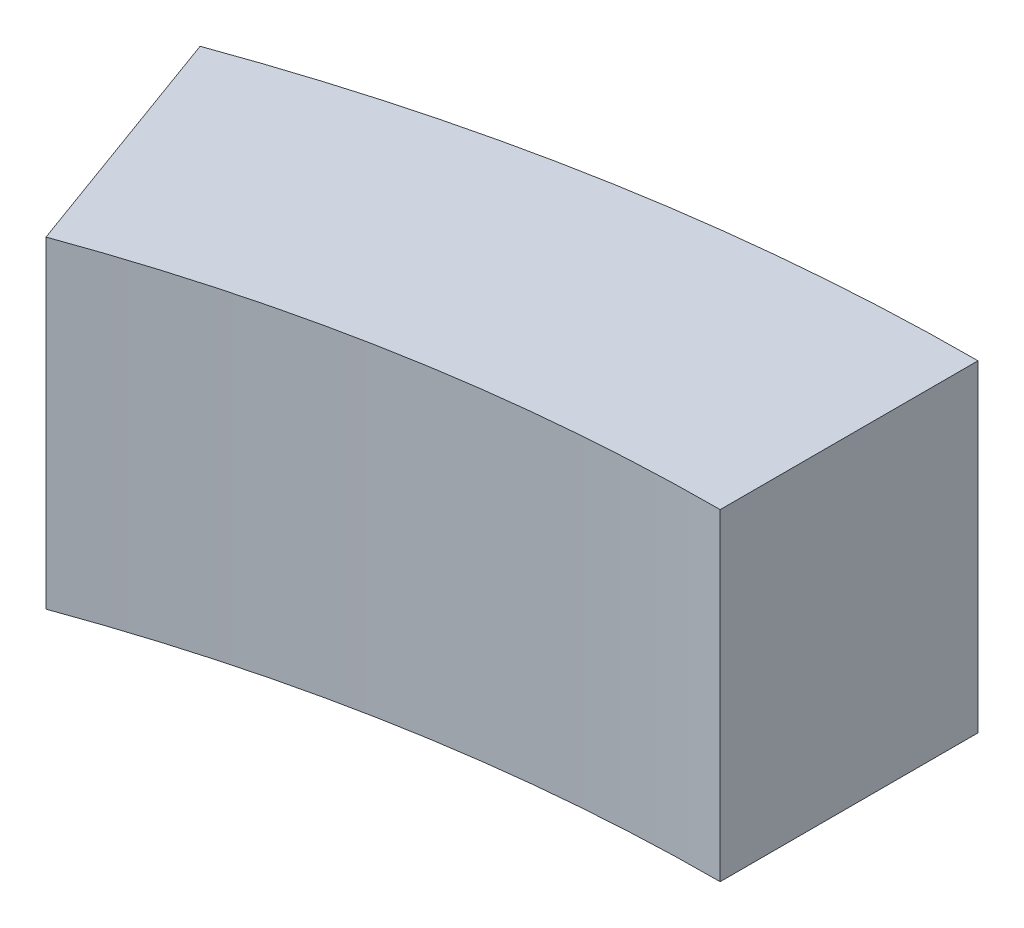
ISO-10303-21;
HEADER;
FILE_DESCRIPTION(('STEP AP214'),'2;1');
FILE_NAME('part.step','',(''),(''),'','','');
FILE_SCHEMA(('AUTOMOTIVE_DESIGN { 1 0 10303 214 1 1 1 1 }'));
ENDSEC;
DATA;
#1=APPLICATION_CONTEXT('core data for automotive mechanical design processes');
#2=APPLICATION_PROTOCOL_DEFINITION('international standard','automotive_design',2000,#1);
#3=PRODUCT_CONTEXT('',#1,'mechanical');
#4=PRODUCT('Part','Part','',(#3));
#5=PRODUCT_RELATED_PRODUCT_CATEGORY('part','',(#4));
#6=PRODUCT_DEFINITION_FORMATION('','',#4);
#7=PRODUCT_DEFINITION_CONTEXT('part definition',#1,'design');
#8=PRODUCT_DEFINITION('design','',#6,#7);
#9=PRODUCT_DEFINITION_SHAPE('','',#8);
#10=(LENGTH_UNIT() NAMED_UNIT(*) SI_UNIT(.MILLI.,.METRE.));
#11=(NAMED_UNIT(*) PLANE_ANGLE_UNIT() SI_UNIT($,.RADIAN.));
#12=(NAMED_UNIT(*) SI_UNIT($,.STERADIAN.) SOLID_ANGLE_UNIT());
#13=UNCERTAINTY_MEASURE_WITH_UNIT(LENGTH_MEASURE(1.E-05),#10,'distance_accuracy_value','');
#14=(GEOMETRIC_REPRESENTATION_CONTEXT(3) GLOBAL_UNCERTAINTY_ASSIGNED_CONTEXT((#13)) GLOBAL_UNIT_ASSIGNED_CONTEXT((#10,
#11,#12)) REPRESENTATION_CONTEXT('',''));
#15=CARTESIAN_POINT('',(0.,0.,0.));
#16=DIRECTION('',(0.,0.,1.));
#17=DIRECTION('',(1.,0.,0.));
#18=AXIS2_PLACEMENT_3D('',#15,#16,#17);
#19=CARTESIAN_POINT('',(0.,10.,0.));
#20=DIRECTION('',(0.,-1.,0.));
#21=DIRECTION('',(0.,0.,-1.));
#22=AXIS2_PLACEMENT_3D('',#19,#20,#21);
#23=CYLINDRICAL_SURFACE('',#22,60.);
#24=CARTESIAN_POINT('',(0.,0.,0.));
#25=DIRECTION('',(0.,1.,0.));
#26=DIRECTION('',(0.,0.,-1.));
#27=AXIS2_PLACEMENT_3D('',#24,#25,#26);
#28=CIRCLE('',#27,60.);
#29=CARTESIAN_POINT('',(0.,0.,-60.));
#30=VERTEX_POINT('',#29);
#31=CARTESIAN_POINT('',(-20.5212085995398,0.,-56.3815572471546));
#32=VERTEX_POINT('',#31);
#33=EDGE_CURVE('E97',#30,#32,#28,.T.);
#34=ORIENTED_EDGE('',*,*,#33,.T.);
#35=DIRECTION('',(0.,-1.,0.));
#36=VECTOR('',#35,1.);
#37=CARTESIAN_POINT('',(-20.5212085995398,10.,-56.3815572471546));
#38=LINE('',#37,#36);
#39=CARTESIAN_POINT('',(-20.5212085995398,10.,-56.3815572471546));
#40=VERTEX_POINT('',#39);
#41=EDGE_CURVE('E11',#40,#32,#38,.T.);
#42=ORIENTED_EDGE('',*,*,#41,.F.);
#43=CARTESIAN_POINT('',(0.,10.,0.));
#44=DIRECTION('',(0.,1.,0.));
#45=DIRECTION('',(0.,0.,-1.));
#46=AXIS2_PLACEMENT_3D('',#43,#44,#45);
#47=CIRCLE('',#46,60.);
#48=CARTESIAN_POINT('',(0.,10.,-60.));
#49=VERTEX_POINT('',#48);
#50=EDGE_CURVE('E85',#49,#40,#47,.T.);
#51=ORIENTED_EDGE('',*,*,#50,.F.);
#52=DIRECTION('',(0.,-1.,0.));
#53=VECTOR('',#52,1.);
#54=CARTESIAN_POINT('',(0.,10.,-60.));
#55=LINE('',#54,#53);
#56=EDGE_CURVE('E93',#49,#30,#55,.T.);
#57=ORIENTED_EDGE('',*,*,#56,.T.);
#58=EDGE_LOOP('',(#34,#42,#51,#57));
#59=FACE_BOUND('',#58,.T.);
#60=ADVANCED_FACE('F34',(#59),#23,.T.);
#61=CARTESIAN_POINT('',(-20.5212085995398,10.,-56.3815572471546));
#62=DIRECTION('',(0.93969262078591,0.,-0.342020143325664));
#63=DIRECTION('',(-0.342020143325664,0.,-0.93969262078591));
#64=AXIS2_PLACEMENT_3D('',#61,#62,#63);
#65=PLANE('',#64);
#66=DIRECTION('',(0.342020143325664,0.,0.93969262078591));
#67=VECTOR('',#66,1.);
#68=CARTESIAN_POINT('',(-20.5212085995398,0.,-56.3815572471546));
#69=LINE('',#68,#67);
#70=CARTESIAN_POINT('',(-17.7850474529345,0.,-48.8640162808673));
#71=VERTEX_POINT('',#70);
#72=EDGE_CURVE('E89',#32,#71,#69,.T.);
#73=ORIENTED_EDGE('',*,*,#72,.T.);
#74=DIRECTION('',(0.,-1.,0.));
#75=VECTOR('',#74,1.);
#76=CARTESIAN_POINT('',(-17.7850474529345,10.,-48.8640162808673));
#77=LINE('',#76,#75);
#78=CARTESIAN_POINT('',(-17.7850474529345,10.,-48.8640162808673));
#79=VERTEX_POINT('',#78);
#80=EDGE_CURVE('E42',#79,#71,#77,.T.);
#81=ORIENTED_EDGE('',*,*,#80,.F.);
#82=DIRECTION('',(0.342020143325664,0.,0.93969262078591));
#83=VECTOR('',#82,1.);
#84=CARTESIAN_POINT('',(-20.5212085995398,10.,-56.3815572471546));
#85=LINE('',#84,#83);
#86=EDGE_CURVE('E80',#40,#79,#85,.T.);
#87=ORIENTED_EDGE('',*,*,#86,.F.);
#88=ORIENTED_EDGE('',*,*,#41,.T.);
#89=EDGE_LOOP('',(#73,#81,#87,#88));
#90=FACE_BOUND('',#89,.T.);
#91=ADVANCED_FACE('F88',(#90),#65,.F.);
#92=CARTESIAN_POINT('',(0.,10.,0.));
#93=DIRECTION('',(0.,-1.,0.));
#94=DIRECTION('',(0.,0.,-1.));
#95=AXIS2_PLACEMENT_3D('',#92,#93,#94);
#96=CYLINDRICAL_SURFACE('',#95,52.);
#97=CARTESIAN_POINT('',(0.,0.,0.));
#98=DIRECTION('',(0.,-1.,0.));
#99=DIRECTION('',(0.,0.,-1.));
#100=AXIS2_PLACEMENT_3D('',#97,#98,#99);
#101=CIRCLE('',#100,52.);
#102=CARTESIAN_POINT('',(0.,0.,-52.));
#103=VERTEX_POINT('',#102);
#104=EDGE_CURVE('E67',#71,#103,#101,.T.);
#105=ORIENTED_EDGE('',*,*,#104,.T.);
#106=DIRECTION('',(0.,-1.,0.));
#107=VECTOR('',#106,1.);
#108=CARTESIAN_POINT('',(0.,10.,-52.));
#109=LINE('',#108,#107);
#110=CARTESIAN_POINT('',(0.,10.,-52.));
#111=VERTEX_POINT('',#110);
#112=EDGE_CURVE('E90',#111,#103,#109,.T.);
#113=ORIENTED_EDGE('',*,*,#112,.F.);
#114=CARTESIAN_POINT('',(0.,10.,0.));
#115=DIRECTION('',(0.,-1.,0.));
#116=DIRECTION('',(0.,0.,-1.));
#117=AXIS2_PLACEMENT_3D('',#114,#115,#116);
#118=CIRCLE('',#117,52.);
#119=EDGE_CURVE('E83',#79,#111,#118,.T.);
#120=ORIENTED_EDGE('',*,*,#119,.F.);
#121=ORIENTED_EDGE('',*,*,#80,.T.);
#122=EDGE_LOOP('',(#105,#113,#120,#121));
#123=FACE_BOUND('',#122,.T.);
#124=ADVANCED_FACE('F91',(#123),#96,.F.);
#125=CARTESIAN_POINT('',(0.,10.,-52.));
#126=DIRECTION('',(-1.,0.,0.));
#127=DIRECTION('',(0.,0.,1.));
#128=AXIS2_PLACEMENT_3D('',#125,#126,#127);
#129=PLANE('',#128);
#130=DIRECTION('',(0.,0.,-1.));
#131=VECTOR('',#130,1.);
#132=CARTESIAN_POINT('',(0.,0.,-52.));
#133=LINE('',#132,#131);
#134=EDGE_CURVE('E73',#103,#30,#133,.T.);
#135=ORIENTED_EDGE('',*,*,#134,.T.);
#136=ORIENTED_EDGE('',*,*,#56,.F.);
#137=DIRECTION('',(0.,0.,-1.));
#138=VECTOR('',#137,1.);
#139=CARTESIAN_POINT('',(0.,10.,-52.));
#140=LINE('',#139,#138);
#141=EDGE_CURVE('E50',#111,#49,#140,.T.);
#142=ORIENTED_EDGE('',*,*,#141,.F.);
#143=ORIENTED_EDGE('',*,*,#112,.T.);
#144=EDGE_LOOP('',(#135,#136,#142,#143));
#145=FACE_BOUND('',#144,.T.);
#146=ADVANCED_FACE('F104',(#145),#129,.F.);
#147=CARTESIAN_POINT('',(0.,10.,0.));
#148=DIRECTION('',(0.,-1.,0.));
#149=DIRECTION('',(0.,0.,-1.));
#150=AXIS2_PLACEMENT_3D('',#147,#148,#149);
#151=PLANE('',#150);
#152=ORIENTED_EDGE('',*,*,#50,.T.);
#153=ORIENTED_EDGE('',*,*,#86,.T.);
#154=ORIENTED_EDGE('',*,*,#119,.T.);
#155=ORIENTED_EDGE('',*,*,#141,.T.);
#156=EDGE_LOOP('',(#152,#153,#154,#155));
#157=FACE_BOUND('',#156,.T.);
#158=ADVANCED_FACE('F81',(#157),#151,.F.);
#159=CARTESIAN_POINT('',(0.,0.,0.));
#160=DIRECTION('',(0.,-1.,0.));
#161=DIRECTION('',(0.,0.,-1.));
#162=AXIS2_PLACEMENT_3D('',#159,#160,#161);
#163=PLANE('',#162);
#164=ORIENTED_EDGE('',*,*,#33,.F.);
#165=ORIENTED_EDGE('',*,*,#134,.F.);
#166=ORIENTED_EDGE('',*,*,#104,.F.);
#167=ORIENTED_EDGE('',*,*,#72,.F.);
#168=EDGE_LOOP('',(#164,#165,#166,#167));
#169=FACE_BOUND('',#168,.T.);
#170=ADVANCED_FACE('F107',(#169),#163,.T.);
#171=CLOSED_SHELL('',(#60,#91,#124,#146,#158,#170));
#172=MANIFOLD_SOLID_BREP('B2',#171);
#173=ADVANCED_BREP_SHAPE_REPRESENTATION('',(#18,#172),#14);
#174=SHAPE_DEFINITION_REPRESENTATION(#9,#173);
ENDSEC;
END-ISO-10303-21;
